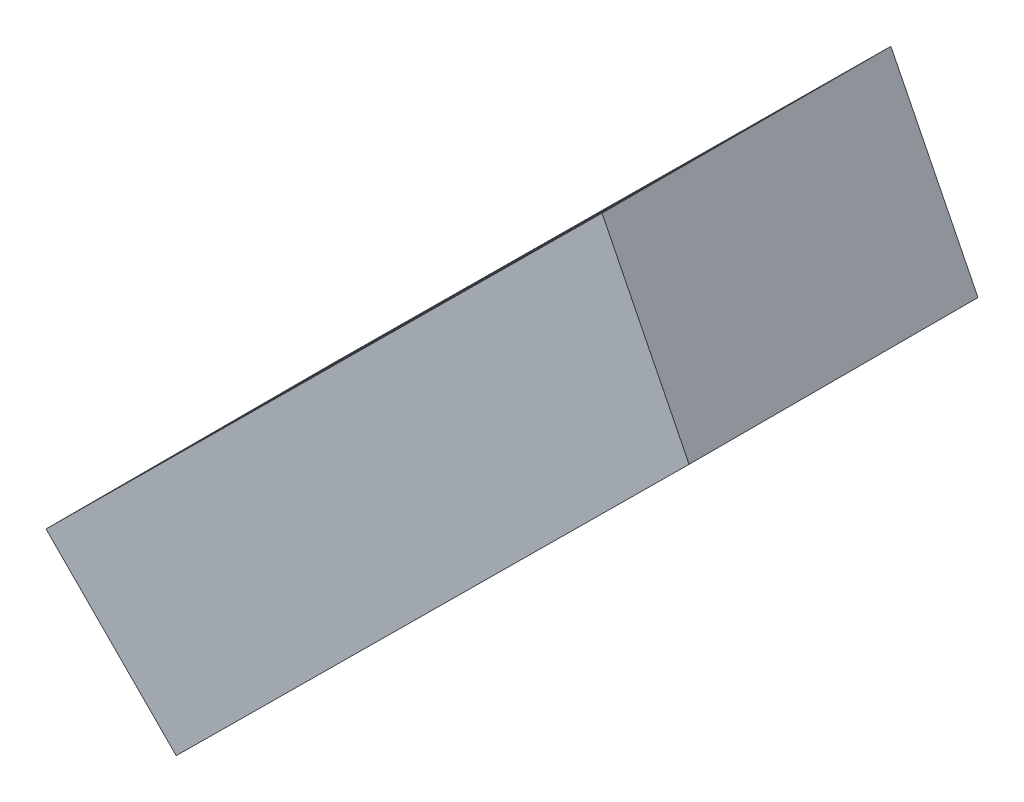
ISO-10303-21;
HEADER;
FILE_DESCRIPTION(('STEP AP214'),'2;1');
FILE_NAME('part.step','',(''),(''),'','','');
FILE_SCHEMA(('AUTOMOTIVE_DESIGN { 1 0 10303 214 1 1 1 1 }'));
ENDSEC;
DATA;
#1=APPLICATION_CONTEXT('core data for automotive mechanical design processes');
#2=APPLICATION_PROTOCOL_DEFINITION('international standard','automotive_design',2000,#1);
#3=PRODUCT_CONTEXT('',#1,'mechanical');
#4=PRODUCT('Part','Part','',(#3));
#5=PRODUCT_RELATED_PRODUCT_CATEGORY('part','',(#4));
#6=PRODUCT_DEFINITION_FORMATION('','',#4);
#7=PRODUCT_DEFINITION_CONTEXT('part definition',#1,'design');
#8=PRODUCT_DEFINITION('design','',#6,#7);
#9=PRODUCT_DEFINITION_SHAPE('','',#8);
#10=(LENGTH_UNIT() NAMED_UNIT(*) SI_UNIT(.MILLI.,.METRE.));
#11=(NAMED_UNIT(*) PLANE_ANGLE_UNIT() SI_UNIT($,.RADIAN.));
#12=(NAMED_UNIT(*) SI_UNIT($,.STERADIAN.) SOLID_ANGLE_UNIT());
#13=UNCERTAINTY_MEASURE_WITH_UNIT(LENGTH_MEASURE(1.E-05),#10,'distance_accuracy_value','');
#14=(GEOMETRIC_REPRESENTATION_CONTEXT(3) GLOBAL_UNCERTAINTY_ASSIGNED_CONTEXT((#13)) GLOBAL_UNIT_ASSIGNED_CONTEXT((#10,
#11,#12)) REPRESENTATION_CONTEXT('',''));
#15=CARTESIAN_POINT('',(0.,0.,0.));
#16=DIRECTION('',(0.,0.,1.));
#17=DIRECTION('',(1.,0.,0.));
#18=AXIS2_PLACEMENT_3D('',#15,#16,#17);
#19=CARTESIAN_POINT('',(-2.79441188502696,0.234272214063951,0.125));
#20=DIRECTION('',(-0.704236390125891,0.709965567349892,0.));
#21=DIRECTION('',(-0.709965567349892,-0.704236390125891,0.));
#22=AXIS2_PLACEMENT_3D('',#19,#20,#21);
#23=PLANE('',#22);
#24=DIRECTION('',(0.709965567349892,0.704236390125891,0.));
#25=VECTOR('',#24,1.);
#26=CARTESIAN_POINT('',(-2.79441188502696,0.234272214063951,-0.375));
#27=LINE('',#26,#25);
#28=CARTESIAN_POINT('',(-2.79441188502696,0.234272214063951,-0.375));
#29=VERTEX_POINT('',#28);
#30=CARTESIAN_POINT('',(-1.83207531365985,1.18884306126069,-0.375));
#31=VERTEX_POINT('',#30);
#32=EDGE_CURVE('E96',#29,#31,#27,.T.);
#33=ORIENTED_EDGE('',*,*,#32,.F.);
#34=DIRECTION('',(0.,0.,-1.));
#35=VECTOR('',#34,1.);
#36=CARTESIAN_POINT('',(-2.79441188502696,0.234272214063951,0.125));
#37=LINE('',#36,#35);
#38=CARTESIAN_POINT('',(-2.79441188502696,0.234272214063951,0.125));
#39=VERTEX_POINT('',#38);
#40=EDGE_CURVE('E11',#39,#29,#37,.T.);
#41=ORIENTED_EDGE('',*,*,#40,.F.);
#42=DIRECTION('',(0.709965567349892,0.704236390125891,0.));
#43=VECTOR('',#42,1.);
#44=CARTESIAN_POINT('',(-2.79441188502696,0.234272214063951,0.125));
#45=LINE('',#44,#43);
#46=CARTESIAN_POINT('',(-1.83207531365985,1.18884306126069,0.125));
#47=VERTEX_POINT('',#46);
#48=EDGE_CURVE('E90',#39,#47,#45,.T.);
#49=ORIENTED_EDGE('',*,*,#48,.T.);
#50=DIRECTION('',(0.,0.,-1.));
#51=VECTOR('',#50,1.);
#52=CARTESIAN_POINT('',(-1.83207531365985,1.18884306126069,0.125));
#53=LINE('',#52,#51);
#54=EDGE_CURVE('E35',#47,#31,#53,.T.);
#55=ORIENTED_EDGE('',*,*,#54,.T.);
#56=EDGE_LOOP('',(#33,#41,#49,#55));
#57=FACE_BOUND('',#56,.T.);
#58=ADVANCED_FACE('F32',(#57),#23,.T.);
#59=CARTESIAN_POINT('',(-2.56905624018668,0.00708323251198487,0.125));
#60=DIRECTION('',(-0.709965567349892,-0.704236390125891,0.));
#61=DIRECTION('',(0.704236390125891,-0.709965567349892,0.));
#62=AXIS2_PLACEMENT_3D('',#59,#60,#61);
#63=PLANE('',#62);
#64=DIRECTION('',(-0.704236390125891,0.709965567349892,0.));
#65=VECTOR('',#64,1.);
#66=CARTESIAN_POINT('',(-2.56905624018668,0.00708323251198487,-0.375));
#67=LINE('',#66,#65);
#68=CARTESIAN_POINT('',(-2.56905624018668,0.00708323251198487,-0.375));
#69=VERTEX_POINT('',#68);
#70=EDGE_CURVE('E92',#69,#29,#67,.T.);
#71=ORIENTED_EDGE('',*,*,#70,.F.);
#72=DIRECTION('',(0.,0.,-1.));
#73=VECTOR('',#72,1.);
#74=CARTESIAN_POINT('',(-2.56905624018668,0.00708323251198487,0.125));
#75=LINE('',#74,#73);
#76=CARTESIAN_POINT('',(-2.56905624018668,0.00708323251198487,0.125));
#77=VERTEX_POINT('',#76);
#78=EDGE_CURVE('E41',#77,#69,#75,.T.);
#79=ORIENTED_EDGE('',*,*,#78,.F.);
#80=DIRECTION('',(-0.704236390125891,0.709965567349892,0.));
#81=VECTOR('',#80,1.);
#82=CARTESIAN_POINT('',(-2.56905624018668,0.00708323251198487,0.125));
#83=LINE('',#82,#81);
#84=EDGE_CURVE('E87',#77,#39,#83,.T.);
#85=ORIENTED_EDGE('',*,*,#84,.T.);
#86=ORIENTED_EDGE('',*,*,#40,.T.);
#87=EDGE_LOOP('',(#71,#79,#85,#86));
#88=FACE_BOUND('',#87,.T.);
#89=ADVANCED_FACE('F106',(#88),#63,.T.);
#90=CARTESIAN_POINT('',(-1.68130444498759,0.887671176956165,0.125));
#91=DIRECTION('',(0.704236390125891,-0.709965567349892,0.));
#92=DIRECTION('',(0.709965567349892,0.704236390125891,0.));
#93=AXIS2_PLACEMENT_3D('',#90,#91,#92);
#94=PLANE('',#93);
#95=DIRECTION('',(-0.709965567349892,-0.704236390125891,0.));
#96=VECTOR('',#95,1.);
#97=CARTESIAN_POINT('',(-1.68130444498759,0.887671176956165,-0.375));
#98=LINE('',#97,#96);
#99=CARTESIAN_POINT('',(-1.68130444498759,0.887671176956165,-0.375));
#100=VERTEX_POINT('',#99);
#101=EDGE_CURVE('E82',#100,#69,#98,.T.);
#102=ORIENTED_EDGE('',*,*,#101,.F.);
#103=DIRECTION('',(0.,0.,-1.));
#104=VECTOR('',#103,1.);
#105=CARTESIAN_POINT('',(-1.68130444498759,0.887671176956165,0.125));
#106=LINE('',#105,#104);
#107=CARTESIAN_POINT('',(-1.68130444498759,0.887671176956165,0.125));
#108=VERTEX_POINT('',#107);
#109=EDGE_CURVE('E77',#108,#100,#106,.T.);
#110=ORIENTED_EDGE('',*,*,#109,.F.);
#111=DIRECTION('',(-0.709965567349892,-0.704236390125891,0.));
#112=VECTOR('',#111,1.);
#113=CARTESIAN_POINT('',(-1.68130444498759,0.887671176956165,0.125));
#114=LINE('',#113,#112);
#115=EDGE_CURVE('E80',#108,#77,#114,.T.);
#116=ORIENTED_EDGE('',*,*,#115,.T.);
#117=ORIENTED_EDGE('',*,*,#78,.T.);
#118=EDGE_LOOP('',(#102,#110,#116,#117));
#119=FACE_BOUND('',#118,.T.);
#120=ADVANCED_FACE('F79',(#119),#94,.T.);
#121=CARTESIAN_POINT('',(-1.83207531365985,1.18884306126069,0.125));
#122=DIRECTION('',(0.894207457497345,0.447652792860867,0.));
#123=DIRECTION('',(-0.447652792860867,0.894207457497345,0.));
#124=AXIS2_PLACEMENT_3D('',#121,#122,#123);
#125=PLANE('',#124);
#126=DIRECTION('',(0.447652792860867,-0.894207457497345,0.));
#127=VECTOR('',#126,1.);
#128=CARTESIAN_POINT('',(-1.83207531365985,1.18884306126069,-0.375));
#129=LINE('',#128,#127);
#130=EDGE_CURVE('E99',#31,#100,#129,.T.);
#131=ORIENTED_EDGE('',*,*,#130,.F.);
#132=ORIENTED_EDGE('',*,*,#54,.F.);
#133=DIRECTION('',(0.447652792860867,-0.894207457497345,0.));
#134=VECTOR('',#133,1.);
#135=CARTESIAN_POINT('',(-1.83207531365985,1.18884306126069,0.125));
#136=LINE('',#135,#134);
#137=EDGE_CURVE('E86',#47,#108,#136,.T.);
#138=ORIENTED_EDGE('',*,*,#137,.T.);
#139=ORIENTED_EDGE('',*,*,#109,.T.);
#140=EDGE_LOOP('',(#131,#132,#138,#139));
#141=FACE_BOUND('',#140,.T.);
#142=ADVANCED_FACE('F89',(#141),#125,.T.);
#143=CARTESIAN_POINT('',(0.,0.,0.125));
#144=DIRECTION('',(0.,0.,1.));
#145=DIRECTION('',(1.,0.,0.));
#146=AXIS2_PLACEMENT_3D('',#143,#144,#145);
#147=PLANE('',#146);
#148=ORIENTED_EDGE('',*,*,#48,.F.);
#149=ORIENTED_EDGE('',*,*,#84,.F.);
#150=ORIENTED_EDGE('',*,*,#115,.F.);
#151=ORIENTED_EDGE('',*,*,#137,.F.);
#152=EDGE_LOOP('',(#148,#149,#150,#151));
#153=FACE_BOUND('',#152,.T.);
#154=ADVANCED_FACE('F85',(#153),#147,.T.);
#155=CARTESIAN_POINT('',(0.,0.,-0.375));
#156=DIRECTION('',(0.,0.,1.));
#157=DIRECTION('',(1.,0.,0.));
#158=AXIS2_PLACEMENT_3D('',#155,#156,#157);
#159=PLANE('',#158);
#160=ORIENTED_EDGE('',*,*,#32,.T.);
#161=ORIENTED_EDGE('',*,*,#130,.T.);
#162=ORIENTED_EDGE('',*,*,#101,.T.);
#163=ORIENTED_EDGE('',*,*,#70,.T.);
#164=EDGE_LOOP('',(#160,#161,#162,#163));
#165=FACE_BOUND('',#164,.T.);
#166=ADVANCED_FACE('F105',(#165),#159,.F.);
#167=CLOSED_SHELL('',(#58,#89,#120,#142,#154,#166));
#168=MANIFOLD_SOLID_BREP('B2',#167);
#169=ADVANCED_BREP_SHAPE_REPRESENTATION('',(#18,#168),#14);
#170=SHAPE_DEFINITION_REPRESENTATION(#9,#169);
ENDSEC;
END-ISO-10303-21;
